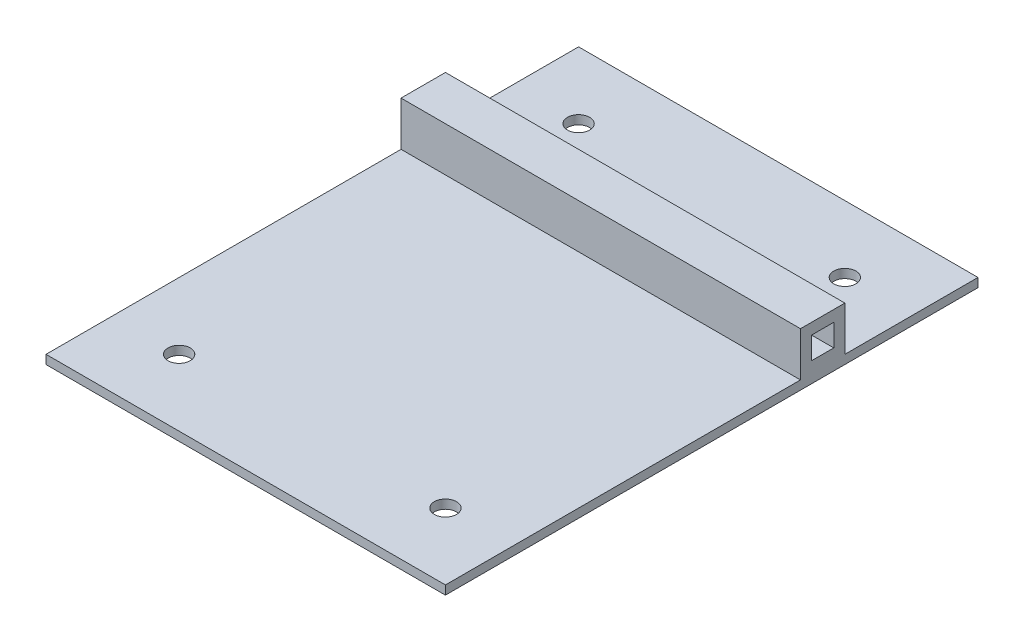
ISO-10303-21;
HEADER;
FILE_DESCRIPTION(('STEP AP214'),'2;1');
FILE_NAME('part.step','',(''),(''),'','','');
FILE_SCHEMA(('AUTOMOTIVE_DESIGN { 1 0 10303 214 1 1 1 1 }'));
ENDSEC;
DATA;
#1=APPLICATION_CONTEXT('core data for automotive mechanical design processes');
#2=APPLICATION_PROTOCOL_DEFINITION('international standard','automotive_design',2000,#1);
#3=PRODUCT_CONTEXT('',#1,'mechanical');
#4=PRODUCT('Part','Part','',(#3));
#5=PRODUCT_RELATED_PRODUCT_CATEGORY('part','',(#4));
#6=PRODUCT_DEFINITION_FORMATION('','',#4);
#7=PRODUCT_DEFINITION_CONTEXT('part definition',#1,'design');
#8=PRODUCT_DEFINITION('design','',#6,#7);
#9=PRODUCT_DEFINITION_SHAPE('','',#8);
#10=(LENGTH_UNIT() NAMED_UNIT(*) SI_UNIT(.MILLI.,.METRE.));
#11=(NAMED_UNIT(*) PLANE_ANGLE_UNIT() SI_UNIT($,.RADIAN.));
#12=(NAMED_UNIT(*) SI_UNIT($,.STERADIAN.) SOLID_ANGLE_UNIT());
#13=UNCERTAINTY_MEASURE_WITH_UNIT(LENGTH_MEASURE(1.E-05),#10,'distance_accuracy_value','');
#14=(GEOMETRIC_REPRESENTATION_CONTEXT(3) GLOBAL_UNCERTAINTY_ASSIGNED_CONTEXT((#13)) GLOBAL_UNIT_ASSIGNED_CONTEXT((#10,
#11,#12)) REPRESENTATION_CONTEXT('',''));
#15=CARTESIAN_POINT('',(0.,0.,0.));
#16=DIRECTION('',(0.,0.,1.));
#17=DIRECTION('',(1.,0.,0.));
#18=AXIS2_PLACEMENT_3D('',#15,#16,#17);
#19=CARTESIAN_POINT('',(0.,2.54,0.));
#20=DIRECTION('',(0.,1.,0.));
#21=DIRECTION('',(0.,0.,1.));
#22=AXIS2_PLACEMENT_3D('',#19,#20,#21);
#23=PLANE('',#22);
#24=CARTESIAN_POINT('',(38.1,2.54,-57.15));
#25=DIRECTION('',(0.,1.,0.));
#26=DIRECTION('',(0.,0.,1.));
#27=AXIS2_PLACEMENT_3D('',#24,#25,#26);
#28=CIRCLE('',#27,3.175);
#29=CARTESIAN_POINT('',(38.1,2.54,-53.975));
#30=VERTEX_POINT('',#29);
#31=EDGE_CURVE('E333',#30,#30,#28,.T.);
#32=ORIENTED_EDGE('',*,*,#31,.F.);
#33=EDGE_LOOP('',(#32));
#34=FACE_BOUND('',#33,.T.);
#35=CARTESIAN_POINT('',(-38.1,2.54,-57.15));
#36=DIRECTION('',(0.,1.,0.));
#37=DIRECTION('',(0.,0.,1.));
#38=AXIS2_PLACEMENT_3D('',#35,#36,#37);
#39=CIRCLE('',#38,3.175);
#40=CARTESIAN_POINT('',(-38.1,2.54,-53.975));
#41=VERTEX_POINT('',#40);
#42=EDGE_CURVE('E157',#41,#41,#39,.T.);
#43=ORIENTED_EDGE('',*,*,#42,.F.);
#44=EDGE_LOOP('',(#43));
#45=FACE_BOUND('',#44,.T.);
#46=DIRECTION('',(-1.,0.,0.));
#47=VECTOR('',#46,1.);
#48=CARTESIAN_POINT('',(-57.15,2.54,-38.1));
#49=LINE('',#48,#47);
#50=CARTESIAN_POINT('',(57.15,2.54,-38.1));
#51=VERTEX_POINT('',#50);
#52=CARTESIAN_POINT('',(-57.15,2.54,-38.1));
#53=VERTEX_POINT('',#52);
#54=EDGE_CURVE('E187',#51,#53,#49,.T.);
#55=ORIENTED_EDGE('',*,*,#54,.F.);
#56=DIRECTION('',(0.,0.,-1.));
#57=VECTOR('',#56,1.);
#58=CARTESIAN_POINT('',(57.15,2.54,76.2));
#59=LINE('',#58,#57);
#60=CARTESIAN_POINT('',(57.15,2.54,-76.2));
#61=VERTEX_POINT('',#60);
#62=EDGE_CURVE('E223',#51,#61,#59,.T.);
#63=ORIENTED_EDGE('',*,*,#62,.T.);
#64=DIRECTION('',(1.,0.,0.));
#65=VECTOR('',#64,1.);
#66=CARTESIAN_POINT('',(-57.15,2.54,-76.2));
#67=LINE('',#66,#65);
#68=CARTESIAN_POINT('',(-57.15,2.54,-76.2));
#69=VERTEX_POINT('',#68);
#70=EDGE_CURVE('E228',#69,#61,#67,.T.);
#71=ORIENTED_EDGE('',*,*,#70,.F.);
#72=DIRECTION('',(0.,0.,-1.));
#73=VECTOR('',#72,1.);
#74=CARTESIAN_POINT('',(-57.15,2.54,76.2));
#75=LINE('',#74,#73);
#76=EDGE_CURVE('E232',#53,#69,#75,.T.);
#77=ORIENTED_EDGE('',*,*,#76,.F.);
#78=EDGE_LOOP('',(#55,#63,#71,#77));
#79=FACE_BOUND('',#78,.T.);
#80=ADVANCED_FACE('F39',(#34,#45,#79),#23,.T.);
#81=CARTESIAN_POINT('',(-57.15,2.54,76.2));
#82=DIRECTION('',(0.,0.,-1.));
#83=DIRECTION('',(-1.,0.,0.));
#84=AXIS2_PLACEMENT_3D('',#81,#82,#83);
#85=PLANE('',#84);
#86=DIRECTION('',(1.,0.,0.));
#87=VECTOR('',#86,1.);
#88=CARTESIAN_POINT('',(-57.15,0.,76.2));
#89=LINE('',#88,#87);
#90=CARTESIAN_POINT('',(-57.15,0.,76.2));
#91=VERTEX_POINT('',#90);
#92=CARTESIAN_POINT('',(57.15,0.,76.2));
#93=VERTEX_POINT('',#92);
#94=EDGE_CURVE('E218',#91,#93,#89,.T.);
#95=ORIENTED_EDGE('',*,*,#94,.T.);
#96=DIRECTION('',(0.,-1.,0.));
#97=VECTOR('',#96,1.);
#98=CARTESIAN_POINT('',(57.15,2.54,76.2));
#99=LINE('',#98,#97);
#100=CARTESIAN_POINT('',(57.15,2.54,76.2));
#101=VERTEX_POINT('',#100);
#102=EDGE_CURVE('E11',#101,#93,#99,.T.);
#103=ORIENTED_EDGE('',*,*,#102,.F.);
#104=DIRECTION('',(1.,0.,0.));
#105=VECTOR('',#104,1.);
#106=CARTESIAN_POINT('',(-57.15,2.54,76.2));
#107=LINE('',#106,#105);
#108=CARTESIAN_POINT('',(-57.15,2.54,76.2));
#109=VERTEX_POINT('',#108);
#110=EDGE_CURVE('E219',#109,#101,#107,.T.);
#111=ORIENTED_EDGE('',*,*,#110,.F.);
#112=DIRECTION('',(0.,-1.,0.));
#113=VECTOR('',#112,1.);
#114=CARTESIAN_POINT('',(-57.15,2.54,76.2));
#115=LINE('',#114,#113);
#116=EDGE_CURVE('E237',#109,#91,#115,.T.);
#117=ORIENTED_EDGE('',*,*,#116,.T.);
#118=EDGE_LOOP('',(#95,#103,#111,#117));
#119=FACE_BOUND('',#118,.T.);
#120=ADVANCED_FACE('F41',(#119),#85,.F.);
#121=CARTESIAN_POINT('',(57.15,2.54,76.2));
#122=DIRECTION('',(-1.,0.,0.));
#123=DIRECTION('',(0.,0.,1.));
#124=AXIS2_PLACEMENT_3D('',#121,#122,#123);
#125=PLANE('',#124);
#126=DIRECTION('',(0.,0.,-1.));
#127=VECTOR('',#126,1.);
#128=CARTESIAN_POINT('',(57.15,12.065,-34.925));
#129=LINE('',#128,#127);
#130=CARTESIAN_POINT('',(57.15,12.065,-28.575));
#131=VERTEX_POINT('',#130);
#132=CARTESIAN_POINT('',(57.15,12.065,-34.925));
#133=VERTEX_POINT('',#132);
#134=EDGE_CURVE('E138',#131,#133,#129,.T.);
#135=ORIENTED_EDGE('',*,*,#134,.T.);
#136=DIRECTION('',(0.,-1.,0.));
#137=VECTOR('',#136,1.);
#138=CARTESIAN_POINT('',(57.15,12.065,-34.925));
#139=LINE('',#138,#137);
#140=CARTESIAN_POINT('',(57.15,5.715,-34.925));
#141=VERTEX_POINT('',#140);
#142=EDGE_CURVE('E131',#133,#141,#139,.T.);
#143=ORIENTED_EDGE('',*,*,#142,.T.);
#144=DIRECTION('',(0.,0.,1.));
#145=VECTOR('',#144,1.);
#146=CARTESIAN_POINT('',(57.15,5.715,-34.925));
#147=LINE('',#146,#145);
#148=CARTESIAN_POINT('',(57.15,5.715,-28.575));
#149=VERTEX_POINT('',#148);
#150=EDGE_CURVE('E141',#141,#149,#147,.T.);
#151=ORIENTED_EDGE('',*,*,#150,.T.);
#152=DIRECTION('',(0.,1.,0.));
#153=VECTOR('',#152,1.);
#154=CARTESIAN_POINT('',(57.15,12.065,-28.575));
#155=LINE('',#154,#153);
#156=EDGE_CURVE('E55',#149,#131,#155,.T.);
#157=ORIENTED_EDGE('',*,*,#156,.T.);
#158=EDGE_LOOP('',(#135,#143,#151,#157));
#159=FACE_BOUND('',#158,.T.);
#160=DIRECTION('',(0.,0.,-1.));
#161=VECTOR('',#160,1.);
#162=CARTESIAN_POINT('',(57.15,0.,76.2));
#163=LINE('',#162,#161);
#164=CARTESIAN_POINT('',(57.15,0.,-76.2));
#165=VERTEX_POINT('',#164);
#166=EDGE_CURVE('E241',#93,#165,#163,.T.);
#167=ORIENTED_EDGE('',*,*,#166,.T.);
#168=DIRECTION('',(0.,-1.,0.));
#169=VECTOR('',#168,1.);
#170=CARTESIAN_POINT('',(57.15,2.54,-76.2));
#171=LINE('',#170,#169);
#172=EDGE_CURVE('E48',#61,#165,#171,.T.);
#173=ORIENTED_EDGE('',*,*,#172,.F.);
#174=ORIENTED_EDGE('',*,*,#62,.F.);
#175=DIRECTION('',(0.,-1.,0.));
#176=VECTOR('',#175,1.);
#177=CARTESIAN_POINT('',(57.15,15.24,-38.1));
#178=LINE('',#177,#176);
#179=CARTESIAN_POINT('',(57.15,15.24,-38.1));
#180=VERTEX_POINT('',#179);
#181=EDGE_CURVE('E206',#180,#51,#178,.T.);
#182=ORIENTED_EDGE('',*,*,#181,.F.);
#183=DIRECTION('',(0.,0.,-1.));
#184=VECTOR('',#183,1.);
#185=CARTESIAN_POINT('',(57.15,15.24,-38.1));
#186=LINE('',#185,#184);
#187=CARTESIAN_POINT('',(57.15,15.24,-25.4));
#188=VERTEX_POINT('',#187);
#189=EDGE_CURVE('E190',#188,#180,#186,.T.);
#190=ORIENTED_EDGE('',*,*,#189,.F.);
#191=DIRECTION('',(0.,-1.,0.));
#192=VECTOR('',#191,1.);
#193=CARTESIAN_POINT('',(57.15,15.24,-25.4));
#194=LINE('',#193,#192);
#195=CARTESIAN_POINT('',(57.15,2.54,-25.4));
#196=VERTEX_POINT('',#195);
#197=EDGE_CURVE('E210',#188,#196,#194,.T.);
#198=ORIENTED_EDGE('',*,*,#197,.T.);
#199=EDGE_CURVE('E225',#101,#196,#59,.T.);
#200=ORIENTED_EDGE('',*,*,#199,.F.);
#201=ORIENTED_EDGE('',*,*,#102,.T.);
#202=EDGE_LOOP('',(#167,#173,#174,#182,#190,#198,#200,#201));
#203=FACE_BOUND('',#202,.T.);
#204=ADVANCED_FACE('F146',(#159,#203),#125,.F.);
#205=CARTESIAN_POINT('',(-57.15,2.54,-76.2));
#206=DIRECTION('',(0.,0.,-1.));
#207=DIRECTION('',(-1.,0.,0.));
#208=AXIS2_PLACEMENT_3D('',#205,#206,#207);
#209=PLANE('',#208);
#210=DIRECTION('',(1.,0.,0.));
#211=VECTOR('',#210,1.);
#212=CARTESIAN_POINT('',(-57.15,0.,-76.2));
#213=LINE('',#212,#211);
#214=CARTESIAN_POINT('',(-57.15,0.,-76.2));
#215=VERTEX_POINT('',#214);
#216=EDGE_CURVE('E245',#215,#165,#213,.T.);
#217=ORIENTED_EDGE('',*,*,#216,.F.);
#218=DIRECTION('',(0.,-1.,0.));
#219=VECTOR('',#218,1.);
#220=CARTESIAN_POINT('',(-57.15,2.54,-76.2));
#221=LINE('',#220,#219);
#222=EDGE_CURVE('E254',#69,#215,#221,.T.);
#223=ORIENTED_EDGE('',*,*,#222,.F.);
#224=ORIENTED_EDGE('',*,*,#70,.T.);
#225=ORIENTED_EDGE('',*,*,#172,.T.);
#226=EDGE_LOOP('',(#217,#223,#224,#225));
#227=FACE_BOUND('',#226,.T.);
#228=ADVANCED_FACE('F260',(#227),#209,.T.);
#229=CARTESIAN_POINT('',(-57.15,2.54,76.2));
#230=DIRECTION('',(-1.,0.,0.));
#231=DIRECTION('',(0.,0.,1.));
#232=AXIS2_PLACEMENT_3D('',#229,#230,#231);
#233=PLANE('',#232);
#234=DIRECTION('',(0.,-1.,0.));
#235=VECTOR('',#234,1.);
#236=CARTESIAN_POINT('',(-57.15,12.065,-34.925));
#237=LINE('',#236,#235);
#238=CARTESIAN_POINT('',(-57.15,12.065,-34.925));
#239=VERTEX_POINT('',#238);
#240=CARTESIAN_POINT('',(-57.15,5.715,-34.925));
#241=VERTEX_POINT('',#240);
#242=EDGE_CURVE('E63',#239,#241,#237,.T.);
#243=ORIENTED_EDGE('',*,*,#242,.F.);
#244=DIRECTION('',(0.,0.,-1.));
#245=VECTOR('',#244,1.);
#246=CARTESIAN_POINT('',(-57.15,12.065,-34.925));
#247=LINE('',#246,#245);
#248=CARTESIAN_POINT('',(-57.15,12.065,-28.575));
#249=VERTEX_POINT('',#248);
#250=EDGE_CURVE('E150',#249,#239,#247,.T.);
#251=ORIENTED_EDGE('',*,*,#250,.F.);
#252=DIRECTION('',(0.,1.,0.));
#253=VECTOR('',#252,1.);
#254=CARTESIAN_POINT('',(-57.15,12.065,-28.575));
#255=LINE('',#254,#253);
#256=CARTESIAN_POINT('',(-57.15,5.715,-28.575));
#257=VERTEX_POINT('',#256);
#258=EDGE_CURVE('E154',#257,#249,#255,.T.);
#259=ORIENTED_EDGE('',*,*,#258,.F.);
#260=DIRECTION('',(0.,0.,1.));
#261=VECTOR('',#260,1.);
#262=CARTESIAN_POINT('',(-57.15,5.715,-34.925));
#263=LINE('',#262,#261);
#264=EDGE_CURVE('E166',#241,#257,#263,.T.);
#265=ORIENTED_EDGE('',*,*,#264,.F.);
#266=EDGE_LOOP('',(#243,#251,#259,#265));
#267=FACE_BOUND('',#266,.T.);
#268=DIRECTION('',(0.,0.,-1.));
#269=VECTOR('',#268,1.);
#270=CARTESIAN_POINT('',(-57.15,0.,76.2));
#271=LINE('',#270,#269);
#272=EDGE_CURVE('E224',#91,#215,#271,.T.);
#273=ORIENTED_EDGE('',*,*,#272,.F.);
#274=ORIENTED_EDGE('',*,*,#116,.F.);
#275=CARTESIAN_POINT('',(-57.15,2.54,-25.4));
#276=VERTEX_POINT('',#275);
#277=EDGE_CURVE('E233',#109,#276,#75,.T.);
#278=ORIENTED_EDGE('',*,*,#277,.T.);
#279=DIRECTION('',(0.,-1.,0.));
#280=VECTOR('',#279,1.);
#281=CARTESIAN_POINT('',(-57.15,15.24,-25.4));
#282=LINE('',#281,#280);
#283=CARTESIAN_POINT('',(-57.15,15.24,-25.4));
#284=VERTEX_POINT('',#283);
#285=EDGE_CURVE('E214',#284,#276,#282,.T.);
#286=ORIENTED_EDGE('',*,*,#285,.F.);
#287=DIRECTION('',(0.,0.,1.));
#288=VECTOR('',#287,1.);
#289=CARTESIAN_POINT('',(-57.15,15.24,-38.1));
#290=LINE('',#289,#288);
#291=CARTESIAN_POINT('',(-57.15,15.24,-38.1));
#292=VERTEX_POINT('',#291);
#293=EDGE_CURVE('E182',#292,#284,#290,.T.);
#294=ORIENTED_EDGE('',*,*,#293,.F.);
#295=DIRECTION('',(0.,-1.,0.));
#296=VECTOR('',#295,1.);
#297=CARTESIAN_POINT('',(-57.15,15.24,-38.1));
#298=LINE('',#297,#296);
#299=EDGE_CURVE('E196',#292,#53,#298,.T.);
#300=ORIENTED_EDGE('',*,*,#299,.T.);
#301=ORIENTED_EDGE('',*,*,#76,.T.);
#302=ORIENTED_EDGE('',*,*,#222,.T.);
#303=EDGE_LOOP('',(#273,#274,#278,#286,#294,#300,#301,#302));
#304=FACE_BOUND('',#303,.T.);
#305=ADVANCED_FACE('F270',(#267,#304),#233,.T.);
#306=CARTESIAN_POINT('',(-38.1,2.54,57.15));
#307=DIRECTION('',(0.,1.,0.));
#308=DIRECTION('',(0.,0.,1.));
#309=AXIS2_PLACEMENT_3D('',#306,#307,#308);
#310=CIRCLE('',#309,3.175);
#311=CARTESIAN_POINT('',(-38.1,2.54,60.325));
#312=VERTEX_POINT('',#311);
#313=EDGE_CURVE('E317',#312,#312,#310,.T.);
#314=ORIENTED_EDGE('',*,*,#313,.F.);
#315=EDGE_LOOP('',(#314));
#316=FACE_BOUND('',#315,.T.);
#317=CARTESIAN_POINT('',(38.1,2.54,57.15));
#318=DIRECTION('',(0.,1.,0.));
#319=DIRECTION('',(0.,0.,1.));
#320=AXIS2_PLACEMENT_3D('',#317,#318,#319);
#321=CIRCLE('',#320,3.175);
#322=CARTESIAN_POINT('',(38.1,2.54,60.325));
#323=VERTEX_POINT('',#322);
#324=EDGE_CURVE('E320',#323,#323,#321,.T.);
#325=ORIENTED_EDGE('',*,*,#324,.F.);
#326=EDGE_LOOP('',(#325));
#327=FACE_BOUND('',#326,.T.);
#328=DIRECTION('',(1.,0.,0.));
#329=VECTOR('',#328,1.);
#330=CARTESIAN_POINT('',(-57.15,2.54,-25.4));
#331=LINE('',#330,#329);
#332=EDGE_CURVE('E176',#276,#196,#331,.T.);
#333=ORIENTED_EDGE('',*,*,#332,.F.);
#334=ORIENTED_EDGE('',*,*,#277,.F.);
#335=ORIENTED_EDGE('',*,*,#110,.T.);
#336=ORIENTED_EDGE('',*,*,#199,.T.);
#337=EDGE_LOOP('',(#333,#334,#335,#336));
#338=FACE_BOUND('',#337,.T.);
#339=ADVANCED_FACE('F290',(#316,#327,#338),#23,.T.);
#340=CARTESIAN_POINT('',(0.,0.,0.));
#341=DIRECTION('',(0.,1.,0.));
#342=DIRECTION('',(0.,0.,1.));
#343=AXIS2_PLACEMENT_3D('',#340,#341,#342);
#344=PLANE('',#343);
#345=CARTESIAN_POINT('',(38.1,0.,-57.15));
#346=DIRECTION('',(0.,1.,0.));
#347=DIRECTION('',(0.,0.,1.));
#348=AXIS2_PLACEMENT_3D('',#345,#346,#347);
#349=CIRCLE('',#348,3.175);
#350=CARTESIAN_POINT('',(38.1,0.,-53.975));
#351=VERTEX_POINT('',#350);
#352=EDGE_CURVE('E329',#351,#351,#349,.T.);
#353=ORIENTED_EDGE('',*,*,#352,.T.);
#354=EDGE_LOOP('',(#353));
#355=FACE_BOUND('',#354,.T.);
#356=CARTESIAN_POINT('',(-38.1,0.,57.15));
#357=DIRECTION('',(0.,1.,0.));
#358=DIRECTION('',(0.,0.,1.));
#359=AXIS2_PLACEMENT_3D('',#356,#357,#358);
#360=CIRCLE('',#359,3.175);
#361=CARTESIAN_POINT('',(-38.1,0.,60.325));
#362=VERTEX_POINT('',#361);
#363=EDGE_CURVE('E337',#362,#362,#360,.T.);
#364=ORIENTED_EDGE('',*,*,#363,.T.);
#365=EDGE_LOOP('',(#364));
#366=FACE_BOUND('',#365,.T.);
#367=CARTESIAN_POINT('',(38.1,0.,57.15));
#368=DIRECTION('',(0.,1.,0.));
#369=DIRECTION('',(0.,0.,1.));
#370=AXIS2_PLACEMENT_3D('',#367,#368,#369);
#371=CIRCLE('',#370,3.175);
#372=CARTESIAN_POINT('',(38.1,0.,60.325));
#373=VERTEX_POINT('',#372);
#374=EDGE_CURVE('E323',#373,#373,#371,.T.);
#375=ORIENTED_EDGE('',*,*,#374,.T.);
#376=EDGE_LOOP('',(#375));
#377=FACE_BOUND('',#376,.T.);
#378=CARTESIAN_POINT('',(-38.1,0.,-57.15));
#379=DIRECTION('',(0.,1.,0.));
#380=DIRECTION('',(0.,0.,1.));
#381=AXIS2_PLACEMENT_3D('',#378,#379,#380);
#382=CIRCLE('',#381,3.175);
#383=CARTESIAN_POINT('',(-38.1,0.,-53.975));
#384=VERTEX_POINT('',#383);
#385=EDGE_CURVE('E167',#384,#384,#382,.T.);
#386=ORIENTED_EDGE('',*,*,#385,.T.);
#387=EDGE_LOOP('',(#386));
#388=FACE_BOUND('',#387,.T.);
#389=ORIENTED_EDGE('',*,*,#94,.F.);
#390=ORIENTED_EDGE('',*,*,#272,.T.);
#391=ORIENTED_EDGE('',*,*,#216,.T.);
#392=ORIENTED_EDGE('',*,*,#166,.F.);
#393=EDGE_LOOP('',(#389,#390,#391,#392));
#394=FACE_BOUND('',#393,.T.);
#395=ADVANCED_FACE('F267',(#355,#366,#377,#388,#394),#344,.F.);
#396=CARTESIAN_POINT('',(-57.15,15.24,-25.4));
#397=DIRECTION('',(0.,0.,-1.));
#398=DIRECTION('',(-1.,0.,0.));
#399=AXIS2_PLACEMENT_3D('',#396,#397,#398);
#400=PLANE('',#399);
#401=ORIENTED_EDGE('',*,*,#332,.T.);
#402=ORIENTED_EDGE('',*,*,#197,.F.);
#403=DIRECTION('',(1.,0.,0.));
#404=VECTOR('',#403,1.);
#405=CARTESIAN_POINT('',(-57.15,15.24,-25.4));
#406=LINE('',#405,#404);
#407=EDGE_CURVE('E186',#284,#188,#406,.T.);
#408=ORIENTED_EDGE('',*,*,#407,.F.);
#409=ORIENTED_EDGE('',*,*,#285,.T.);
#410=EDGE_LOOP('',(#401,#402,#408,#409));
#411=FACE_BOUND('',#410,.T.);
#412=ADVANCED_FACE('F287',(#411),#400,.F.);
#413=CARTESIAN_POINT('',(-57.15,15.24,-38.1));
#414=DIRECTION('',(0.,0.,1.));
#415=DIRECTION('',(1.,0.,0.));
#416=AXIS2_PLACEMENT_3D('',#413,#414,#415);
#417=PLANE('',#416);
#418=ORIENTED_EDGE('',*,*,#54,.T.);
#419=ORIENTED_EDGE('',*,*,#299,.F.);
#420=DIRECTION('',(-1.,0.,0.));
#421=VECTOR('',#420,1.);
#422=CARTESIAN_POINT('',(-57.15,15.24,-38.1));
#423=LINE('',#422,#421);
#424=EDGE_CURVE('E193',#180,#292,#423,.T.);
#425=ORIENTED_EDGE('',*,*,#424,.F.);
#426=ORIENTED_EDGE('',*,*,#181,.T.);
#427=EDGE_LOOP('',(#418,#419,#425,#426));
#428=FACE_BOUND('',#427,.T.);
#429=ADVANCED_FACE('F279',(#428),#417,.F.);
#430=CARTESIAN_POINT('',(0.,15.24,0.));
#431=DIRECTION('',(0.,1.,0.));
#432=DIRECTION('',(0.,0.,1.));
#433=AXIS2_PLACEMENT_3D('',#430,#431,#432);
#434=PLANE('',#433);
#435=ORIENTED_EDGE('',*,*,#293,.T.);
#436=ORIENTED_EDGE('',*,*,#407,.T.);
#437=ORIENTED_EDGE('',*,*,#189,.T.);
#438=ORIENTED_EDGE('',*,*,#424,.T.);
#439=EDGE_LOOP('',(#435,#436,#437,#438));
#440=FACE_BOUND('',#439,.T.);
#441=ADVANCED_FACE('F283',(#440),#434,.T.);
#442=CARTESIAN_POINT('',(57.15,12.065,-34.925));
#443=DIRECTION('',(0.,0.,-1.));
#444=DIRECTION('',(-1.,0.,0.));
#445=AXIS2_PLACEMENT_3D('',#442,#443,#444);
#446=PLANE('',#445);
#447=ORIENTED_EDGE('',*,*,#242,.T.);
#448=DIRECTION('',(-1.,0.,0.));
#449=VECTOR('',#448,1.);
#450=CARTESIAN_POINT('',(57.15,5.715,-34.925));
#451=LINE('',#450,#449);
#452=EDGE_CURVE('E127',#141,#241,#451,.T.);
#453=ORIENTED_EDGE('',*,*,#452,.F.);
#454=ORIENTED_EDGE('',*,*,#142,.F.);
#455=DIRECTION('',(-1.,0.,0.));
#456=VECTOR('',#455,1.);
#457=CARTESIAN_POINT('',(57.15,12.065,-34.925));
#458=LINE('',#457,#456);
#459=EDGE_CURVE('E173',#133,#239,#458,.T.);
#460=ORIENTED_EDGE('',*,*,#459,.T.);
#461=EDGE_LOOP('',(#447,#453,#454,#460));
#462=FACE_BOUND('',#461,.T.);
#463=ADVANCED_FACE('F129',(#462),#446,.F.);
#464=CARTESIAN_POINT('',(57.15,12.065,-34.925));
#465=DIRECTION('',(0.,1.,0.));
#466=DIRECTION('',(0.,0.,1.));
#467=AXIS2_PLACEMENT_3D('',#464,#465,#466);
#468=PLANE('',#467);
#469=ORIENTED_EDGE('',*,*,#250,.T.);
#470=ORIENTED_EDGE('',*,*,#459,.F.);
#471=ORIENTED_EDGE('',*,*,#134,.F.);
#472=DIRECTION('',(-1.,0.,0.));
#473=VECTOR('',#472,1.);
#474=CARTESIAN_POINT('',(57.15,12.065,-28.575));
#475=LINE('',#474,#473);
#476=EDGE_CURVE('E177',#131,#249,#475,.T.);
#477=ORIENTED_EDGE('',*,*,#476,.T.);
#478=EDGE_LOOP('',(#469,#470,#471,#477));
#479=FACE_BOUND('',#478,.T.);
#480=ADVANCED_FACE('F367',(#479),#468,.F.);
#481=CARTESIAN_POINT('',(57.15,12.065,-28.575));
#482=DIRECTION('',(0.,0.,1.));
#483=DIRECTION('',(1.,0.,0.));
#484=AXIS2_PLACEMENT_3D('',#481,#482,#483);
#485=PLANE('',#484);
#486=ORIENTED_EDGE('',*,*,#258,.T.);
#487=ORIENTED_EDGE('',*,*,#476,.F.);
#488=ORIENTED_EDGE('',*,*,#156,.F.);
#489=DIRECTION('',(-1.,0.,0.));
#490=VECTOR('',#489,1.);
#491=CARTESIAN_POINT('',(57.15,5.715,-28.575));
#492=LINE('',#491,#490);
#493=EDGE_CURVE('E137',#149,#257,#492,.T.);
#494=ORIENTED_EDGE('',*,*,#493,.T.);
#495=EDGE_LOOP('',(#486,#487,#488,#494));
#496=FACE_BOUND('',#495,.T.);
#497=ADVANCED_FACE('F362',(#496),#485,.F.);
#498=CARTESIAN_POINT('',(57.15,5.715,-34.925));
#499=DIRECTION('',(0.,-1.,0.));
#500=DIRECTION('',(0.,0.,-1.));
#501=AXIS2_PLACEMENT_3D('',#498,#499,#500);
#502=PLANE('',#501);
#503=ORIENTED_EDGE('',*,*,#264,.T.);
#504=ORIENTED_EDGE('',*,*,#493,.F.);
#505=ORIENTED_EDGE('',*,*,#150,.F.);
#506=ORIENTED_EDGE('',*,*,#452,.T.);
#507=EDGE_LOOP('',(#503,#504,#505,#506));
#508=FACE_BOUND('',#507,.T.);
#509=ADVANCED_FACE('F142',(#508),#502,.F.);
#510=CARTESIAN_POINT('',(-38.1,0.,-57.15));
#511=DIRECTION('',(0.,1.,0.));
#512=DIRECTION('',(0.,0.,1.));
#513=AXIS2_PLACEMENT_3D('',#510,#511,#512);
#514=CYLINDRICAL_SURFACE('',#513,3.175);
#515=ORIENTED_EDGE('',*,*,#385,.F.);
#516=EDGE_LOOP('',(#515));
#517=FACE_BOUND('',#516,.T.);
#518=ORIENTED_EDGE('',*,*,#42,.T.);
#519=EDGE_LOOP('',(#518));
#520=FACE_BOUND('',#519,.T.);
#521=ADVANCED_FACE('F350',(#517,#520),#514,.F.);
#522=CARTESIAN_POINT('',(38.1,0.,57.15));
#523=DIRECTION('',(0.,1.,0.));
#524=DIRECTION('',(0.,0.,1.));
#525=AXIS2_PLACEMENT_3D('',#522,#523,#524);
#526=CYLINDRICAL_SURFACE('',#525,3.175);
#527=ORIENTED_EDGE('',*,*,#374,.F.);
#528=EDGE_LOOP('',(#527));
#529=FACE_BOUND('',#528,.T.);
#530=ORIENTED_EDGE('',*,*,#324,.T.);
#531=EDGE_LOOP('',(#530));
#532=FACE_BOUND('',#531,.T.);
#533=ADVANCED_FACE('F352',(#529,#532),#526,.F.);
#534=CARTESIAN_POINT('',(-38.1,0.,57.15));
#535=DIRECTION('',(0.,1.,0.));
#536=DIRECTION('',(0.,0.,1.));
#537=AXIS2_PLACEMENT_3D('',#534,#535,#536);
#538=CYLINDRICAL_SURFACE('',#537,3.175);
#539=ORIENTED_EDGE('',*,*,#363,.F.);
#540=EDGE_LOOP('',(#539));
#541=FACE_BOUND('',#540,.T.);
#542=ORIENTED_EDGE('',*,*,#313,.T.);
#543=EDGE_LOOP('',(#542));
#544=FACE_BOUND('',#543,.T.);
#545=ADVANCED_FACE('F359',(#541,#544),#538,.F.);
#546=CARTESIAN_POINT('',(38.1,0.,-57.15));
#547=DIRECTION('',(0.,1.,0.));
#548=DIRECTION('',(0.,0.,1.));
#549=AXIS2_PLACEMENT_3D('',#546,#547,#548);
#550=CYLINDRICAL_SURFACE('',#549,3.175);
#551=ORIENTED_EDGE('',*,*,#352,.F.);
#552=EDGE_LOOP('',(#551));
#553=FACE_BOUND('',#552,.T.);
#554=ORIENTED_EDGE('',*,*,#31,.T.);
#555=EDGE_LOOP('',(#554));
#556=FACE_BOUND('',#555,.T.);
#557=ADVANCED_FACE('F443',(#553,#556),#550,.F.);
#558=CLOSED_SHELL('',(#80,#120,#204,#228,#305,#339,#395,#412,#429,#441,#463,#480,#497,#509,#521,
#533,#545,#557));
#559=MANIFOLD_SOLID_BREP('B2',#558);
#560=ADVANCED_BREP_SHAPE_REPRESENTATION('',(#18,#559),#14);
#561=SHAPE_DEFINITION_REPRESENTATION(#9,#560);
ENDSEC;
END-ISO-10303-21;
